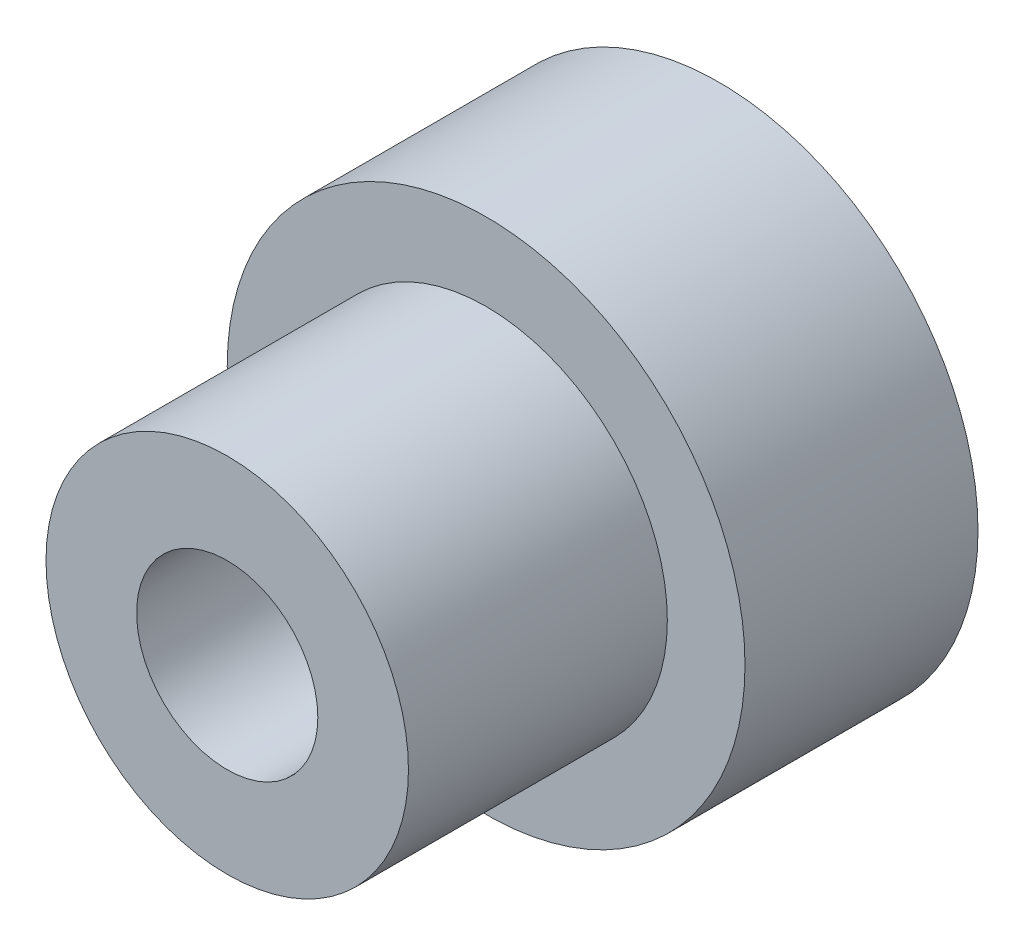
ISO-10303-21;
HEADER;
FILE_DESCRIPTION(('STEP AP214'),'2;1');
FILE_NAME('part.step','',(''),(''),'','','');
FILE_SCHEMA(('AUTOMOTIVE_DESIGN { 1 0 10303 214 1 1 1 1 }'));
ENDSEC;
DATA;
#1=APPLICATION_CONTEXT('core data for automotive mechanical design processes');
#2=APPLICATION_PROTOCOL_DEFINITION('international standard','automotive_design',2000,#1);
#3=PRODUCT_CONTEXT('',#1,'mechanical');
#4=PRODUCT('Part','Part','',(#3));
#5=PRODUCT_RELATED_PRODUCT_CATEGORY('part','',(#4));
#6=PRODUCT_DEFINITION_FORMATION('','',#4);
#7=PRODUCT_DEFINITION_CONTEXT('part definition',#1,'design');
#8=PRODUCT_DEFINITION('design','',#6,#7);
#9=PRODUCT_DEFINITION_SHAPE('','',#8);
#10=(LENGTH_UNIT() NAMED_UNIT(*) SI_UNIT(.MILLI.,.METRE.));
#11=(NAMED_UNIT(*) PLANE_ANGLE_UNIT() SI_UNIT($,.RADIAN.));
#12=(NAMED_UNIT(*) SI_UNIT($,.STERADIAN.) SOLID_ANGLE_UNIT());
#13=UNCERTAINTY_MEASURE_WITH_UNIT(LENGTH_MEASURE(1.E-05),#10,'distance_accuracy_value','');
#14=(GEOMETRIC_REPRESENTATION_CONTEXT(3) GLOBAL_UNCERTAINTY_ASSIGNED_CONTEXT((#13)) GLOBAL_UNIT_ASSIGNED_CONTEXT((#10,
#11,#12)) REPRESENTATION_CONTEXT('',''));
#15=CARTESIAN_POINT('',(0.,0.,0.));
#16=DIRECTION('',(0.,0.,1.));
#17=DIRECTION('',(1.,0.,0.));
#18=AXIS2_PLACEMENT_3D('',#15,#16,#17);
#19=CARTESIAN_POINT('',(0.,0.,-9.));
#20=DIRECTION('',(0.,0.,1.));
#21=DIRECTION('',(1.,0.,0.));
#22=AXIS2_PLACEMENT_3D('',#19,#20,#21);
#23=CYLINDRICAL_SURFACE('',#22,3.5);
#24=CARTESIAN_POINT('',(0.,0.,-9.));
#25=DIRECTION('',(0.,0.,1.));
#26=DIRECTION('',(1.,0.,0.));
#27=AXIS2_PLACEMENT_3D('',#24,#25,#26);
#28=CIRCLE('',#27,3.5);
#29=CARTESIAN_POINT('',(3.5,0.,-9.));
#30=VERTEX_POINT('',#29);
#31=EDGE_CURVE('E75',#30,#30,#28,.T.);
#32=ORIENTED_EDGE('',*,*,#31,.F.);
#33=EDGE_LOOP('',(#32));
#34=FACE_BOUND('',#33,.T.);
#35=CARTESIAN_POINT('',(0.,0.,-5.5));
#36=DIRECTION('',(0.,0.,1.));
#37=DIRECTION('',(1.,0.,0.));
#38=AXIS2_PLACEMENT_3D('',#35,#36,#37);
#39=CIRCLE('',#38,3.5);
#40=CARTESIAN_POINT('',(3.5,0.,-5.5));
#41=VERTEX_POINT('',#40);
#42=EDGE_CURVE('E48',#41,#41,#39,.F.);
#43=ORIENTED_EDGE('',*,*,#42,.F.);
#44=EDGE_LOOP('',(#43));
#45=FACE_BOUND('',#44,.T.);
#46=ADVANCED_FACE('F44',(#34,#45),#23,.F.);
#47=CARTESIAN_POINT('',(0.,0.,10.));
#48=DIRECTION('',(0.,0.,-1.));
#49=DIRECTION('',(-1.,0.,0.));
#50=AXIS2_PLACEMENT_3D('',#47,#48,#49);
#51=CYLINDRICAL_SURFACE('',#50,7.);
#52=CARTESIAN_POINT('',(0.,0.,10.));
#53=DIRECTION('',(0.,0.,1.));
#54=DIRECTION('',(1.,0.,0.));
#55=AXIS2_PLACEMENT_3D('',#52,#53,#54);
#56=CIRCLE('',#55,7.);
#57=CARTESIAN_POINT('',(7.,0.,10.));
#58=VERTEX_POINT('',#57);
#59=EDGE_CURVE('E12',#58,#58,#56,.T.);
#60=ORIENTED_EDGE('',*,*,#59,.F.);
#61=EDGE_LOOP('',(#60));
#62=FACE_BOUND('',#61,.T.);
#63=CARTESIAN_POINT('',(0.,0.,0.));
#64=DIRECTION('',(0.,0.,-1.));
#65=DIRECTION('',(-1.,0.,0.));
#66=AXIS2_PLACEMENT_3D('',#63,#64,#65);
#67=CIRCLE('',#66,7.);
#68=CARTESIAN_POINT('',(-7.,0.,0.));
#69=VERTEX_POINT('',#68);
#70=EDGE_CURVE('E52',#69,#69,#67,.T.);
#71=ORIENTED_EDGE('',*,*,#70,.F.);
#72=EDGE_LOOP('',(#71));
#73=FACE_BOUND('',#72,.T.);
#74=ADVANCED_FACE('F46',(#62,#73),#51,.T.);
#75=CARTESIAN_POINT('',(0.,0.,10.));
#76=DIRECTION('',(0.,0.,1.));
#77=DIRECTION('',(1.,0.,0.));
#78=AXIS2_PLACEMENT_3D('',#75,#76,#77);
#79=PLANE('',#78);
#80=CARTESIAN_POINT('',(0.,0.,10.));
#81=DIRECTION('',(0.,0.,1.));
#82=DIRECTION('',(1.,0.,0.));
#83=AXIS2_PLACEMENT_3D('',#80,#81,#82);
#84=CIRCLE('',#83,3.5);
#85=CARTESIAN_POINT('',(3.5,0.,10.));
#86=VERTEX_POINT('',#85);
#87=EDGE_CURVE('E66',#86,#86,#84,.T.);
#88=ORIENTED_EDGE('',*,*,#87,.F.);
#89=EDGE_LOOP('',(#88));
#90=FACE_BOUND('',#89,.T.);
#91=ORIENTED_EDGE('',*,*,#59,.T.);
#92=EDGE_LOOP('',(#91));
#93=FACE_BOUND('',#92,.T.);
#94=ADVANCED_FACE('F90',(#90,#93),#79,.T.);
#95=CARTESIAN_POINT('',(0.,0.,0.));
#96=DIRECTION('',(0.,0.,-1.));
#97=DIRECTION('',(-1.,0.,0.));
#98=AXIS2_PLACEMENT_3D('',#95,#96,#97);
#99=PLANE('',#98);
#100=CARTESIAN_POINT('',(0.,0.,0.));
#101=DIRECTION('',(0.,0.,-1.));
#102=DIRECTION('',(-1.,0.,0.));
#103=AXIS2_PLACEMENT_3D('',#100,#101,#102);
#104=CIRCLE('',#103,10.);
#105=CARTESIAN_POINT('',(-10.,0.,0.));
#106=VERTEX_POINT('',#105);
#107=EDGE_CURVE('E78',#106,#106,#104,.T.);
#108=ORIENTED_EDGE('',*,*,#107,.F.);
#109=EDGE_LOOP('',(#108));
#110=FACE_BOUND('',#109,.T.);
#111=ORIENTED_EDGE('',*,*,#70,.T.);
#112=EDGE_LOOP('',(#111));
#113=FACE_BOUND('',#112,.T.);
#114=ADVANCED_FACE('F87',(#110,#113),#99,.F.);
#115=CARTESIAN_POINT('',(0.,0.,-9.));
#116=DIRECTION('',(0.,0.,1.));
#117=DIRECTION('',(1.,0.,0.));
#118=AXIS2_PLACEMENT_3D('',#115,#116,#117);
#119=CYLINDRICAL_SURFACE('',#118,10.);
#120=CARTESIAN_POINT('',(0.,0.,-9.));
#121=DIRECTION('',(0.,0.,-1.));
#122=DIRECTION('',(-1.,0.,0.));
#123=AXIS2_PLACEMENT_3D('',#120,#121,#122);
#124=CIRCLE('',#123,10.);
#125=CARTESIAN_POINT('',(-10.,0.,-9.));
#126=VERTEX_POINT('',#125);
#127=EDGE_CURVE('E57',#126,#126,#124,.T.);
#128=ORIENTED_EDGE('',*,*,#127,.F.);
#129=EDGE_LOOP('',(#128));
#130=FACE_BOUND('',#129,.T.);
#131=ORIENTED_EDGE('',*,*,#107,.T.);
#132=EDGE_LOOP('',(#131));
#133=FACE_BOUND('',#132,.T.);
#134=ADVANCED_FACE('F85',(#130,#133),#119,.T.);
#135=CARTESIAN_POINT('',(0.,0.,-9.));
#136=DIRECTION('',(0.,0.,-1.));
#137=DIRECTION('',(-1.,0.,0.));
#138=AXIS2_PLACEMENT_3D('',#135,#136,#137);
#139=PLANE('',#138);
#140=ORIENTED_EDGE('',*,*,#31,.T.);
#141=EDGE_LOOP('',(#140));
#142=FACE_BOUND('',#141,.T.);
#143=ORIENTED_EDGE('',*,*,#127,.T.);
#144=EDGE_LOOP('',(#143));
#145=FACE_BOUND('',#144,.T.);
#146=ADVANCED_FACE('F112',(#142,#145),#139,.T.);
#147=CARTESIAN_POINT('',(0.,0.,-3.));
#148=DIRECTION('',(0.,0.,1.));
#149=DIRECTION('',(1.,0.,0.));
#150=AXIS2_PLACEMENT_3D('',#147,#148,#149);
#151=CIRCLE('',#150,3.5);
#152=CARTESIAN_POINT('',(3.5,0.,-3.));
#153=VERTEX_POINT('',#152);
#154=EDGE_CURVE('E60',#153,#153,#151,.F.);
#155=ORIENTED_EDGE('',*,*,#154,.T.);
#156=EDGE_LOOP('',(#155));
#157=FACE_BOUND('',#156,.T.);
#158=ORIENTED_EDGE('',*,*,#87,.T.);
#159=EDGE_LOOP('',(#158));
#160=FACE_BOUND('',#159,.T.);
#161=ADVANCED_FACE('F103',(#157,#160),#23,.F.);
#162=CARTESIAN_POINT('',(0.,0.,-5.5));
#163=DIRECTION('',(0.,0.,1.));
#164=DIRECTION('',(1.,0.,0.));
#165=AXIS2_PLACEMENT_3D('',#162,#163,#164);
#166=PLANE('',#165);
#167=CARTESIAN_POINT('',(0.,0.,-5.5));
#168=DIRECTION('',(0.,0.,1.));
#169=DIRECTION('',(1.,0.,0.));
#170=AXIS2_PLACEMENT_3D('',#167,#168,#169);
#171=CIRCLE('',#170,5.5);
#172=CARTESIAN_POINT('',(5.5,0.,-5.5));
#173=VERTEX_POINT('',#172);
#174=EDGE_CURVE('E62',#173,#173,#171,.T.);
#175=ORIENTED_EDGE('',*,*,#174,.T.);
#176=EDGE_LOOP('',(#175));
#177=FACE_BOUND('',#176,.T.);
#178=ORIENTED_EDGE('',*,*,#42,.T.);
#179=EDGE_LOOP('',(#178));
#180=FACE_BOUND('',#179,.T.);
#181=ADVANCED_FACE('F111',(#177,#180),#166,.T.);
#182=CARTESIAN_POINT('',(0.,0.,-3.));
#183=DIRECTION('',(0.,0.,1.));
#184=DIRECTION('',(1.,0.,0.));
#185=AXIS2_PLACEMENT_3D('',#182,#183,#184);
#186=PLANE('',#185);
#187=CARTESIAN_POINT('',(0.,0.,-3.));
#188=DIRECTION('',(0.,0.,1.));
#189=DIRECTION('',(1.,0.,0.));
#190=AXIS2_PLACEMENT_3D('',#187,#188,#189);
#191=CIRCLE('',#190,5.5);
#192=CARTESIAN_POINT('',(5.5,0.,-3.));
#193=VERTEX_POINT('',#192);
#194=EDGE_CURVE('E68',#193,#193,#191,.T.);
#195=ORIENTED_EDGE('',*,*,#194,.F.);
#196=EDGE_LOOP('',(#195));
#197=FACE_BOUND('',#196,.T.);
#198=ORIENTED_EDGE('',*,*,#154,.F.);
#199=EDGE_LOOP('',(#198));
#200=FACE_BOUND('',#199,.T.);
#201=ADVANCED_FACE('F117',(#197,#200),#186,.F.);
#202=CARTESIAN_POINT('',(0.,0.,-5.5));
#203=DIRECTION('',(0.,0.,1.));
#204=DIRECTION('',(1.,0.,0.));
#205=AXIS2_PLACEMENT_3D('',#202,#203,#204);
#206=CYLINDRICAL_SURFACE('',#205,5.5);
#207=ORIENTED_EDGE('',*,*,#174,.F.);
#208=EDGE_LOOP('',(#207));
#209=FACE_BOUND('',#208,.T.);
#210=ORIENTED_EDGE('',*,*,#194,.T.);
#211=EDGE_LOOP('',(#210));
#212=FACE_BOUND('',#211,.T.);
#213=ADVANCED_FACE('F158',(#209,#212),#206,.F.);
#214=CLOSED_SHELL('',(#46,#74,#94,#114,#134,#146,#161,#181,#201,#213));
#215=MANIFOLD_SOLID_BREP('B2',#214);
#216=ADVANCED_BREP_SHAPE_REPRESENTATION('',(#18,#215),#14);
#217=SHAPE_DEFINITION_REPRESENTATION(#9,#216);
ENDSEC;
END-ISO-10303-21;
